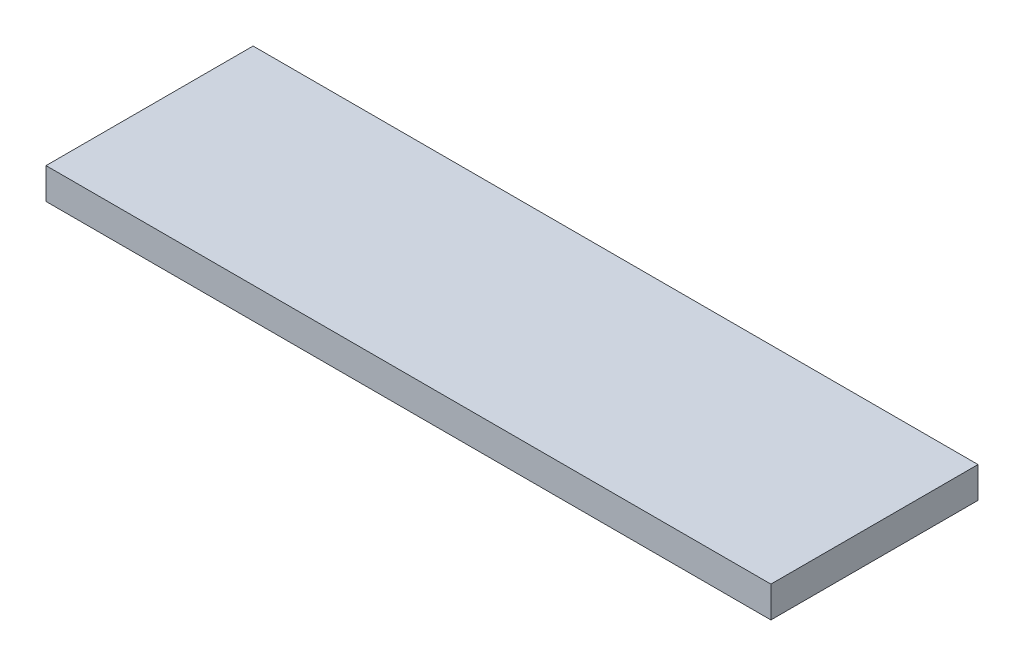
ISO-10303-21;
HEADER;
FILE_DESCRIPTION(('STEP AP214'),'2;1');
FILE_NAME('part.step','',(''),(''),'','','');
FILE_SCHEMA(('AUTOMOTIVE_DESIGN { 1 0 10303 214 1 1 1 1 }'));
ENDSEC;
DATA;
#1=APPLICATION_CONTEXT('core data for automotive mechanical design processes');
#2=APPLICATION_PROTOCOL_DEFINITION('international standard','automotive_design',2000,#1);
#3=PRODUCT_CONTEXT('',#1,'mechanical');
#4=PRODUCT('Part','Part','',(#3));
#5=PRODUCT_RELATED_PRODUCT_CATEGORY('part','',(#4));
#6=PRODUCT_DEFINITION_FORMATION('','',#4);
#7=PRODUCT_DEFINITION_CONTEXT('part definition',#1,'design');
#8=PRODUCT_DEFINITION('design','',#6,#7);
#9=PRODUCT_DEFINITION_SHAPE('','',#8);
#10=(LENGTH_UNIT() NAMED_UNIT(*) SI_UNIT(.MILLI.,.METRE.));
#11=(NAMED_UNIT(*) PLANE_ANGLE_UNIT() SI_UNIT($,.RADIAN.));
#12=(NAMED_UNIT(*) SI_UNIT($,.STERADIAN.) SOLID_ANGLE_UNIT());
#13=UNCERTAINTY_MEASURE_WITH_UNIT(LENGTH_MEASURE(1.E-05),#10,'distance_accuracy_value','');
#14=(GEOMETRIC_REPRESENTATION_CONTEXT(3) GLOBAL_UNCERTAINTY_ASSIGNED_CONTEXT((#13)) GLOBAL_UNIT_ASSIGNED_CONTEXT((#10,
#11,#12)) REPRESENTATION_CONTEXT('',''));
#15=CARTESIAN_POINT('',(0.,0.,0.));
#16=DIRECTION('',(0.,0.,1.));
#17=DIRECTION('',(1.,0.,0.));
#18=AXIS2_PLACEMENT_3D('',#15,#16,#17);
#19=CARTESIAN_POINT('',(0.,3.,0.));
#20=DIRECTION('',(1.,0.,0.));
#21=DIRECTION('',(0.,0.,-1.));
#22=AXIS2_PLACEMENT_3D('',#19,#20,#21);
#23=PLANE('',#22);
#24=DIRECTION('',(0.,0.,1.));
#25=VECTOR('',#24,1.);
#26=CARTESIAN_POINT('',(0.,0.,0.));
#27=LINE('',#26,#25);
#28=CARTESIAN_POINT('',(0.,0.,-20.));
#29=VERTEX_POINT('',#28);
#30=CARTESIAN_POINT('',(0.,0.,0.));
#31=VERTEX_POINT('',#30);
#32=EDGE_CURVE('E107',#29,#31,#27,.T.);
#33=ORIENTED_EDGE('',*,*,#32,.T.);
#34=DIRECTION('',(0.,-1.,0.));
#35=VECTOR('',#34,1.);
#36=CARTESIAN_POINT('',(0.,3.,0.));
#37=LINE('',#36,#35);
#38=CARTESIAN_POINT('',(0.,3.,0.));
#39=VERTEX_POINT('',#38);
#40=EDGE_CURVE('E11',#39,#31,#37,.T.);
#41=ORIENTED_EDGE('',*,*,#40,.F.);
#42=DIRECTION('',(0.,0.,1.));
#43=VECTOR('',#42,1.);
#44=CARTESIAN_POINT('',(0.,3.,0.));
#45=LINE('',#44,#43);
#46=CARTESIAN_POINT('',(0.,3.,-20.));
#47=VERTEX_POINT('',#46);
#48=EDGE_CURVE('E91',#47,#39,#45,.T.);
#49=ORIENTED_EDGE('',*,*,#48,.F.);
#50=DIRECTION('',(0.,-1.,0.));
#51=VECTOR('',#50,1.);
#52=CARTESIAN_POINT('',(0.,3.,-20.));
#53=LINE('',#52,#51);
#54=EDGE_CURVE('E103',#47,#29,#53,.T.);
#55=ORIENTED_EDGE('',*,*,#54,.T.);
#56=EDGE_LOOP('',(#33,#41,#49,#55));
#57=FACE_BOUND('',#56,.T.);
#58=ADVANCED_FACE('F39',(#57),#23,.F.);
#59=CARTESIAN_POINT('',(0.,3.,0.));
#60=DIRECTION('',(0.,0.,-1.));
#61=DIRECTION('',(-1.,0.,0.));
#62=AXIS2_PLACEMENT_3D('',#59,#60,#61);
#63=PLANE('',#62);
#64=DIRECTION('',(1.,0.,0.));
#65=VECTOR('',#64,1.);
#66=CARTESIAN_POINT('',(0.,0.,0.));
#67=LINE('',#66,#65);
#68=CARTESIAN_POINT('',(70.,0.,0.));
#69=VERTEX_POINT('',#68);
#70=EDGE_CURVE('E96',#31,#69,#67,.T.);
#71=ORIENTED_EDGE('',*,*,#70,.T.);
#72=DIRECTION('',(0.,-1.,0.));
#73=VECTOR('',#72,1.);
#74=CARTESIAN_POINT('',(70.,3.,0.));
#75=LINE('',#74,#73);
#76=CARTESIAN_POINT('',(70.,3.,0.));
#77=VERTEX_POINT('',#76);
#78=EDGE_CURVE('E48',#77,#69,#75,.T.);
#79=ORIENTED_EDGE('',*,*,#78,.F.);
#80=DIRECTION('',(1.,0.,0.));
#81=VECTOR('',#80,1.);
#82=CARTESIAN_POINT('',(0.,3.,0.));
#83=LINE('',#82,#81);
#84=EDGE_CURVE('E86',#39,#77,#83,.T.);
#85=ORIENTED_EDGE('',*,*,#84,.F.);
#86=ORIENTED_EDGE('',*,*,#40,.T.);
#87=EDGE_LOOP('',(#71,#79,#85,#86));
#88=FACE_BOUND('',#87,.T.);
#89=ADVANCED_FACE('F95',(#88),#63,.F.);
#90=CARTESIAN_POINT('',(70.,3.,0.));
#91=DIRECTION('',(-1.,0.,0.));
#92=DIRECTION('',(0.,0.,1.));
#93=AXIS2_PLACEMENT_3D('',#90,#91,#92);
#94=PLANE('',#93);
#95=DIRECTION('',(0.,0.,-1.));
#96=VECTOR('',#95,1.);
#97=CARTESIAN_POINT('',(70.,0.,0.));
#98=LINE('',#97,#96);
#99=CARTESIAN_POINT('',(70.,0.,-20.));
#100=VERTEX_POINT('',#99);
#101=EDGE_CURVE('E73',#69,#100,#98,.T.);
#102=ORIENTED_EDGE('',*,*,#101,.T.);
#103=DIRECTION('',(0.,-1.,0.));
#104=VECTOR('',#103,1.);
#105=CARTESIAN_POINT('',(70.,3.,-20.));
#106=LINE('',#105,#104);
#107=CARTESIAN_POINT('',(70.,3.,-20.));
#108=VERTEX_POINT('',#107);
#109=EDGE_CURVE('E98',#108,#100,#106,.T.);
#110=ORIENTED_EDGE('',*,*,#109,.F.);
#111=DIRECTION('',(0.,0.,-1.));
#112=VECTOR('',#111,1.);
#113=CARTESIAN_POINT('',(70.,3.,0.));
#114=LINE('',#113,#112);
#115=EDGE_CURVE('E89',#77,#108,#114,.T.);
#116=ORIENTED_EDGE('',*,*,#115,.F.);
#117=ORIENTED_EDGE('',*,*,#78,.T.);
#118=EDGE_LOOP('',(#102,#110,#116,#117));
#119=FACE_BOUND('',#118,.T.);
#120=ADVANCED_FACE('F99',(#119),#94,.F.);
#121=CARTESIAN_POINT('',(0.,3.,-20.));
#122=DIRECTION('',(0.,0.,1.));
#123=DIRECTION('',(1.,0.,0.));
#124=AXIS2_PLACEMENT_3D('',#121,#122,#123);
#125=PLANE('',#124);
#126=DIRECTION('',(-1.,0.,0.));
#127=VECTOR('',#126,1.);
#128=CARTESIAN_POINT('',(0.,0.,-20.));
#129=LINE('',#128,#127);
#130=EDGE_CURVE('E79',#100,#29,#129,.T.);
#131=ORIENTED_EDGE('',*,*,#130,.T.);
#132=ORIENTED_EDGE('',*,*,#54,.F.);
#133=DIRECTION('',(-1.,0.,0.));
#134=VECTOR('',#133,1.);
#135=CARTESIAN_POINT('',(0.,3.,-20.));
#136=LINE('',#135,#134);
#137=EDGE_CURVE('E56',#108,#47,#136,.T.);
#138=ORIENTED_EDGE('',*,*,#137,.F.);
#139=ORIENTED_EDGE('',*,*,#109,.T.);
#140=EDGE_LOOP('',(#131,#132,#138,#139));
#141=FACE_BOUND('',#140,.T.);
#142=ADVANCED_FACE('F120',(#141),#125,.F.);
#143=CARTESIAN_POINT('',(0.,3.,0.));
#144=DIRECTION('',(0.,-1.,0.));
#145=DIRECTION('',(0.,0.,-1.));
#146=AXIS2_PLACEMENT_3D('',#143,#144,#145);
#147=PLANE('',#146);
#148=ORIENTED_EDGE('',*,*,#48,.T.);
#149=ORIENTED_EDGE('',*,*,#84,.T.);
#150=ORIENTED_EDGE('',*,*,#115,.T.);
#151=ORIENTED_EDGE('',*,*,#137,.T.);
#152=EDGE_LOOP('',(#148,#149,#150,#151));
#153=FACE_BOUND('',#152,.T.);
#154=ADVANCED_FACE('F87',(#153),#147,.F.);
#155=CARTESIAN_POINT('',(0.,0.,0.));
#156=DIRECTION('',(0.,-1.,0.));
#157=DIRECTION('',(0.,0.,-1.));
#158=AXIS2_PLACEMENT_3D('',#155,#156,#157);
#159=PLANE('',#158);
#160=ORIENTED_EDGE('',*,*,#32,.F.);
#161=ORIENTED_EDGE('',*,*,#130,.F.);
#162=ORIENTED_EDGE('',*,*,#101,.F.);
#163=ORIENTED_EDGE('',*,*,#70,.F.);
#164=EDGE_LOOP('',(#160,#161,#162,#163));
#165=FACE_BOUND('',#164,.T.);
#166=ADVANCED_FACE('F123',(#165),#159,.T.);
#167=CLOSED_SHELL('',(#58,#89,#120,#142,#154,#166));
#168=MANIFOLD_SOLID_BREP('B2',#167);
#169=ADVANCED_BREP_SHAPE_REPRESENTATION('',(#18,#168),#14);
#170=SHAPE_DEFINITION_REPRESENTATION(#9,#169);
ENDSEC;
END-ISO-10303-21;
